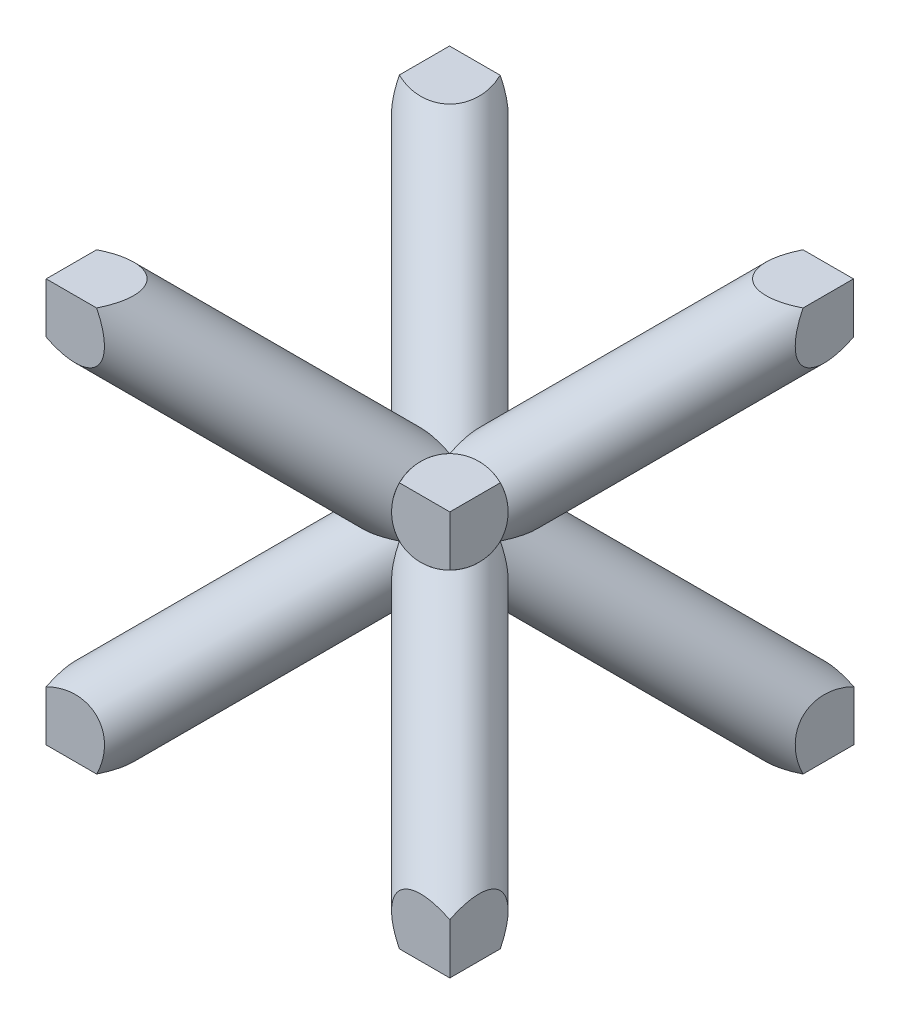
ISO-10303-21;
HEADER;
FILE_DESCRIPTION(('STEP AP214'),'2;1');
FILE_NAME('part.step','',(''),(''),'','','');
FILE_SCHEMA(('AUTOMOTIVE_DESIGN { 1 0 10303 214 1 1 1 1 }'));
ENDSEC;
DATA;
#1=APPLICATION_CONTEXT('core data for automotive mechanical design processes');
#2=APPLICATION_PROTOCOL_DEFINITION('international standard','automotive_design',2000,#1);
#3=PRODUCT_CONTEXT('',#1,'mechanical');
#4=PRODUCT('Part','Part','',(#3));
#5=PRODUCT_RELATED_PRODUCT_CATEGORY('part','',(#4));
#6=PRODUCT_DEFINITION_FORMATION('','',#4);
#7=PRODUCT_DEFINITION_CONTEXT('part definition',#1,'design');
#8=PRODUCT_DEFINITION('design','',#6,#7);
#9=PRODUCT_DEFINITION_SHAPE('','',#8);
#10=(LENGTH_UNIT() NAMED_UNIT(*) SI_UNIT(.MILLI.,.METRE.));
#11=(NAMED_UNIT(*) PLANE_ANGLE_UNIT() SI_UNIT($,.RADIAN.));
#12=(NAMED_UNIT(*) SI_UNIT($,.STERADIAN.) SOLID_ANGLE_UNIT());
#13=UNCERTAINTY_MEASURE_WITH_UNIT(LENGTH_MEASURE(1.E-05),#10,'distance_accuracy_value','');
#14=(GEOMETRIC_REPRESENTATION_CONTEXT(3) GLOBAL_UNCERTAINTY_ASSIGNED_CONTEXT((#13)) GLOBAL_UNIT_ASSIGNED_CONTEXT((#10,
#11,#12)) REPRESENTATION_CONTEXT('',''));
#15=CARTESIAN_POINT('',(0.,0.,0.));
#16=DIRECTION('',(0.,0.,1.));
#17=DIRECTION('',(1.,0.,0.));
#18=AXIS2_PLACEMENT_3D('',#15,#16,#17);
#19=CARTESIAN_POINT('',(-5.00010307764064,9.,0.));
#20=DIRECTION('',(0.,-1.,0.));
#21=DIRECTION('',(0.,0.,-1.));
#22=AXIS2_PLACEMENT_3D('',#19,#20,#21);
#23=PLANE('',#22);
#24=DIRECTION('',(0.999999672320654,0.,-0.000809542207574275));
#25=VECTOR('',#24,1.);
#26=CARTESIAN_POINT('',(-5.00333535670377,9.,-3.99272326227268));
#27=LINE('',#26,#25);
#28=CARTESIAN_POINT('',(2.99960122848684,9.,-3.99920197934588));
#29=VERTEX_POINT('',#28);
#30=CARTESIAN_POINT('',(3.99999999999999,9.,-4.0000118446412));
#31=VERTEX_POINT('',#30);
#32=EDGE_CURVE('E162',#29,#31,#27,.T.);
#33=ORIENTED_EDGE('',*,*,#32,.F.);
#34=CARTESIAN_POINT('',(3.99999999999998,9.,-3.99999999999998));
#35=DIRECTION('',(0.,1.,0.));
#36=DIRECTION('',(0.707106781186548,0.,-0.707106781186548));
#37=AXIS2_PLACEMENT_3D('',#34,#35,#36);
#38=ELLIPSE('',#37,1.41421356237307,0.816496580927711);
#39=CARTESIAN_POINT('',(4.,9.,-3.00000000000001));
#40=VERTEX_POINT('',#39);
#41=EDGE_CURVE('E177',#29,#40,#38,.T.);
#42=ORIENTED_EDGE('',*,*,#41,.T.);
#43=DIRECTION('',(0.,0.,1.));
#44=VECTOR('',#43,1.);
#45=CARTESIAN_POINT('',(3.99999999999999,8.99999999999999,-5.000025));
#46=LINE('',#45,#44);
#47=EDGE_CURVE('E118',#31,#40,#46,.T.);
#48=ORIENTED_EDGE('',*,*,#47,.F.);
#49=EDGE_LOOP('',(#33,#42,#48));
#50=FACE_BOUND('',#49,.T.);
#51=ADVANCED_FACE('F114',(#50),#23,.F.);
#52=CARTESIAN_POINT('',(-5.00010307764064,1.,0.));
#53=DIRECTION('',(0.,1.,0.));
#54=DIRECTION('',(0.,0.,1.));
#55=AXIS2_PLACEMENT_3D('',#52,#53,#54);
#56=PLANE('',#55);
#57=DIRECTION('',(-0.999999672320654,0.,0.000809542207574797));
#58=VECTOR('',#57,1.);
#59=CARTESIAN_POINT('',(-0.00324079879229594,1.,-4.00324739096831));
#60=LINE('',#59,#58);
#61=CARTESIAN_POINT('',(-2.99983716700637,1.00043199204134,-4.00049784205381));
#62=VERTEX_POINT('',#61);
#63=CARTESIAN_POINT('',(-4.,1.,-4.0000118446412));
#64=VERTEX_POINT('',#63);
#65=EDGE_CURVE('E489',#62,#64,#60,.T.);
#66=ORIENTED_EDGE('',*,*,#65,.F.);
#67=CARTESIAN_POINT('',(-4.00000000000001,0.999999999999999,-4.00000000000001));
#68=DIRECTION('',(0.,1.,0.));
#69=DIRECTION('',(-0.707106781186548,0.,-0.707106781186548));
#70=AXIS2_PLACEMENT_3D('',#67,#68,#69);
#71=ELLIPSE('',#70,1.4142135623731,0.816496580927728);
#72=CARTESIAN_POINT('',(-4.,1.,-3.));
#73=VERTEX_POINT('',#72);
#74=EDGE_CURVE('E251',#62,#73,#71,.F.);
#75=ORIENTED_EDGE('',*,*,#74,.T.);
#76=DIRECTION('',(0.,0.,1.));
#77=VECTOR('',#76,1.);
#78=CARTESIAN_POINT('',(-4.,1.,-5.000025));
#79=LINE('',#78,#77);
#80=EDGE_CURVE('E209',#64,#73,#79,.T.);
#81=ORIENTED_EDGE('',*,*,#80,.F.);
#82=EDGE_LOOP('',(#66,#75,#81));
#83=FACE_BOUND('',#82,.T.);
#84=ADVANCED_FACE('F460',(#83),#56,.F.);
#85=CARTESIAN_POINT('',(4.32692070451106,0.673079295488953,-4.32692070451106));
#86=DIRECTION('',(-0.577350269189626,0.577350269189626,0.577350269189626));
#87=DIRECTION('',(-0.707106781186548,-0.707106781186547,0.));
#88=AXIS2_PLACEMENT_3D('',#85,#86,#87);
#89=CYLINDRICAL_SURFACE('',#88,0.816496580927712);
#90=CARTESIAN_POINT('',(0.,5.00000000000002,0.));
#91=DIRECTION('',(0.,1.,0.));
#92=DIRECTION('',(-0.707106781186548,0.,0.707106781186547));
#93=AXIS2_PLACEMENT_3D('',#90,#91,#92);
#94=ELLIPSE('',#93,1.41421356237307,0.816496580927712);
#95=CARTESIAN_POINT('',(0.99999999999999,5.,0.));
#96=VERTEX_POINT('',#95);
#97=CARTESIAN_POINT('',(0.,5.,-0.999999999999998));
#98=VERTEX_POINT('',#97);
#99=EDGE_CURVE('E587',#96,#98,#94,.T.);
#100=ORIENTED_EDGE('',*,*,#99,.F.);
#101=CARTESIAN_POINT('',(0.,5.00000000000001,0.));
#102=DIRECTION('',(0.,0.,1.));
#103=DIRECTION('',(-0.707106781186547,0.707106781186548,0.));
#104=AXIS2_PLACEMENT_3D('',#101,#102,#103);
#105=ELLIPSE('',#104,1.41421356237309,0.81649658092772);
#106=CARTESIAN_POINT('',(0.,4.00000000000001,0.));
#107=VERTEX_POINT('',#106);
#108=EDGE_CURVE('E583',#96,#107,#105,.F.);
#109=ORIENTED_EDGE('',*,*,#108,.T.);
#110=CARTESIAN_POINT('',(0.,5.00000000000001,0.));
#111=DIRECTION('',(-1.,0.,0.));
#112=DIRECTION('',(0.,0.707106781186548,0.707106781186547));
#113=AXIS2_PLACEMENT_3D('',#110,#111,#112);
#114=ELLIPSE('',#113,1.41421356237308,0.81649658092772);
#115=EDGE_CURVE('E573',#107,#98,#114,.F.);
#116=ORIENTED_EDGE('',*,*,#115,.T.);
#117=EDGE_LOOP('',(#100,#109,#116));
#118=FACE_BOUND('',#117,.T.);
#119=CARTESIAN_POINT('',(4.,1.00000000000001,-4.));
#120=DIRECTION('',(1.,0.,0.));
#121=DIRECTION('',(0.,0.707106781186548,0.707106781186547));
#122=AXIS2_PLACEMENT_3D('',#119,#120,#121);
#123=ELLIPSE('',#122,1.41421356237307,0.816496580927712);
#124=CARTESIAN_POINT('',(3.99999999999999,1.99714742185702,-4.00568095123427));
#125=VERTEX_POINT('',#124);
#126=CARTESIAN_POINT('',(4.,1.,-3.00000000000002));
#127=VERTEX_POINT('',#126);
#128=EDGE_CURVE('E247',#125,#127,#123,.T.);
#129=ORIENTED_EDGE('',*,*,#128,.F.);
#130=CARTESIAN_POINT('',(4.00649870638162,0.993501293618386,-4.00649870638162));
#131=DIRECTION('',(-0.000809541942304187,0.000809541942304126,-0.999999344641629));
#132=DIRECTION('',(-0.707106317778199,0.707106317778199,0.0011448651941164));
#133=AXIS2_PLACEMENT_3D('',#130,#131,#132);
#134=ELLIPSE('',#133,1.41650793586478,0.816496580927712);
#135=CARTESIAN_POINT('',(3.00280491320505,1.00012981876958,-4.00566107221018));
#136=VERTEX_POINT('',#135);
#137=EDGE_CURVE('E493',#125,#136,#134,.F.);
#138=ORIENTED_EDGE('',*,*,#137,.T.);
#139=CARTESIAN_POINT('',(4.00000000000001,1.,-4.00000000000001));
#140=DIRECTION('',(0.,-1.,0.));
#141=DIRECTION('',(-0.707106781186548,0.,0.707106781186547));
#142=AXIS2_PLACEMENT_3D('',#139,#140,#141);
#143=ELLIPSE('',#142,1.41421356237307,0.816496580927712);
#144=EDGE_CURVE('E241',#127,#136,#143,.T.);
#145=ORIENTED_EDGE('',*,*,#144,.F.);
#146=EDGE_LOOP('',(#129,#138,#145));
#147=FACE_BOUND('',#146,.T.);
#148=ADVANCED_FACE('F120',(#118,#147),#89,.T.);
#149=CARTESIAN_POINT('',(-4.32692070451106,0.673079295488972,4.32692070451106));
#150=DIRECTION('',(0.577350269189626,0.577350269189625,-0.577350269189626));
#151=DIRECTION('',(-0.707106781186547,0.,-0.707106781186547));
#152=AXIS2_PLACEMENT_3D('',#149,#150,#151);
#153=CYLINDRICAL_SURFACE('',#152,0.816496580927711);
#154=CARTESIAN_POINT('',(0.,5.00000000000002,0.));
#155=DIRECTION('',(0.,0.,-1.));
#156=DIRECTION('',(-0.707106781186548,-0.707106781186547,0.));
#157=AXIS2_PLACEMENT_3D('',#154,#155,#156);
#158=ELLIPSE('',#157,1.41421356237308,0.816496580927719);
#159=CARTESIAN_POINT('',(0.,6.,0.));
#160=VERTEX_POINT('',#159);
#161=EDGE_CURVE('E206',#96,#160,#158,.F.);
#162=ORIENTED_EDGE('',*,*,#161,.F.);
#163=ORIENTED_EDGE('',*,*,#99,.T.);
#164=CARTESIAN_POINT('',(0.,5.00000000000001,0.));
#165=DIRECTION('',(1.,0.,0.));
#166=DIRECTION('',(0.,-0.707106781186547,0.707106781186548));
#167=AXIS2_PLACEMENT_3D('',#164,#165,#166);
#168=ELLIPSE('',#167,1.41421356237308,0.816496580927719);
#169=EDGE_CURVE('E219',#160,#98,#168,.F.);
#170=ORIENTED_EDGE('',*,*,#169,.F.);
#171=EDGE_LOOP('',(#162,#163,#170));
#172=FACE_BOUND('',#171,.T.);
#173=ORIENTED_EDGE('',*,*,#41,.F.);
#174=CARTESIAN_POINT('',(4.0000118446412,9.00001184464122,-4.0000118446412));
#175=DIRECTION('',(-0.000809541942304187,0.000809541942304126,-0.999999344641629));
#176=DIRECTION('',(0.7076789815169,0.706534117448227,-9.26816089267396E-07));
#177=AXIS2_PLACEMENT_3D('',#174,#175,#176);
#178=ELLIPSE('',#177,1.41421448919037,0.816496580927711);
#179=CARTESIAN_POINT('',(3.99999999999999,8.0004107800841,-4.00082105457012));
#180=VERTEX_POINT('',#179);
#181=EDGE_CURVE('E165',#29,#180,#178,.F.);
#182=ORIENTED_EDGE('',*,*,#181,.T.);
#183=CARTESIAN_POINT('',(4.,9.00000000000002,-4.));
#184=DIRECTION('',(1.,0.,0.));
#185=DIRECTION('',(0.,0.707106781186547,-0.707106781186548));
#186=AXIS2_PLACEMENT_3D('',#183,#184,#185);
#187=ELLIPSE('',#186,1.41421356237307,0.816496580927711);
#188=EDGE_CURVE('E176',#40,#180,#187,.T.);
#189=ORIENTED_EDGE('',*,*,#188,.F.);
#190=EDGE_LOOP('',(#173,#182,#189));
#191=FACE_BOUND('',#190,.T.);
#192=ADVANCED_FACE('F461',(#172,#191),#153,.T.);
#193=DIRECTION('',(-0.999999672320654,0.,0.000809542207574275));
#194=VECTOR('',#193,1.);
#195=CARTESIAN_POINT('',(-5.00334059957245,1.,-3.99919959781111));
#196=LINE('',#195,#194);
#197=CARTESIAN_POINT('',(4.,1.,-4.00648818442395));
#198=VERTEX_POINT('',#197);
#199=EDGE_CURVE('E180',#198,#136,#196,.T.);
#200=ORIENTED_EDGE('',*,*,#199,.F.);
#201=DIRECTION('',(0.,0.,1.));
#202=VECTOR('',#201,1.);
#203=CARTESIAN_POINT('',(4.,1.,0.));
#204=LINE('',#203,#202);
#205=EDGE_CURVE('E218',#198,#127,#204,.T.);
#206=ORIENTED_EDGE('',*,*,#205,.T.);
#207=ORIENTED_EDGE('',*,*,#144,.T.);
#208=EDGE_LOOP('',(#200,#206,#207));
#209=FACE_BOUND('',#208,.T.);
#210=ADVANCED_FACE('F455',(#209),#56,.F.);
#211=CARTESIAN_POINT('',(3.99999999999999,1.,-5.000025));
#212=DIRECTION('',(-1.,0.,0.));
#213=DIRECTION('',(0.,0.,1.));
#214=AXIS2_PLACEMENT_3D('',#211,#212,#213);
#215=PLANE('',#214);
#216=DIRECTION('',(0.,-0.999999672320654,-0.000809542207574214));
#217=VECTOR('',#216,1.);
#218=CARTESIAN_POINT('',(3.99999999999999,0.999195690276568,-4.00648883554684));
#219=LINE('',#218,#217);
#220=EDGE_CURVE('E135',#31,#180,#219,.T.);
#221=ORIENTED_EDGE('',*,*,#220,.F.);
#222=ORIENTED_EDGE('',*,*,#47,.T.);
#223=ORIENTED_EDGE('',*,*,#188,.T.);
#224=EDGE_LOOP('',(#221,#222,#223));
#225=FACE_BOUND('',#224,.T.);
#226=ADVANCED_FACE('F172',(#225),#215,.F.);
#227=CARTESIAN_POINT('',(-4.,9.,-5.000025));
#228=DIRECTION('',(1.,0.,0.));
#229=DIRECTION('',(0.,1.,0.));
#230=AXIS2_PLACEMENT_3D('',#227,#228,#229);
#231=PLANE('',#230);
#232=DIRECTION('',(0.,0.999999672320654,0.000809542207574186));
#233=VECTOR('',#232,1.);
#234=CARTESIAN_POINT('',(-4.,0.00323883271653579,-4.0008187651414));
#235=LINE('',#234,#233);
#236=CARTESIAN_POINT('',(-4.,2.00039877151318,-3.99920197934588));
#237=VERTEX_POINT('',#236);
#238=EDGE_CURVE('E169',#64,#237,#235,.T.);
#239=ORIENTED_EDGE('',*,*,#238,.F.);
#240=ORIENTED_EDGE('',*,*,#80,.T.);
#241=CARTESIAN_POINT('',(-4.,1.00000000000001,-4.));
#242=DIRECTION('',(-1.,0.,0.));
#243=DIRECTION('',(0.,-0.707106781186547,-0.707106781186548));
#244=AXIS2_PLACEMENT_3D('',#241,#242,#243);
#245=ELLIPSE('',#244,1.4142135623731,0.816496580927728);
#246=EDGE_CURVE('E257',#237,#73,#245,.F.);
#247=ORIENTED_EDGE('',*,*,#246,.F.);
#248=EDGE_LOOP('',(#239,#240,#247));
#249=FACE_BOUND('',#248,.T.);
#250=ADVANCED_FACE('F448',(#249),#231,.F.);
#251=DIRECTION('',(0.,-0.999999672320654,-0.000809542207574214));
#252=VECTOR('',#251,1.);
#253=CARTESIAN_POINT('',(3.99999999999999,0.999195690276568,-4.00648883554684));
#254=LINE('',#253,#252);
#255=EDGE_CURVE('E123',#125,#198,#254,.T.);
#256=ORIENTED_EDGE('',*,*,#255,.F.);
#257=ORIENTED_EDGE('',*,*,#128,.T.);
#258=ORIENTED_EDGE('',*,*,#205,.F.);
#259=EDGE_LOOP('',(#256,#257,#258));
#260=FACE_BOUND('',#259,.T.);
#261=ADVANCED_FACE('F451',(#260),#215,.F.);
#262=DIRECTION('',(1.,0.,0.));
#263=VECTOR('',#262,1.);
#264=CARTESIAN_POINT('',(-2.8452994616208,1.,4.));
#265=LINE('',#264,#263);
#266=CARTESIAN_POINT('',(-4.,1.,4.));
#267=VERTEX_POINT('',#266);
#268=CARTESIAN_POINT('',(-3.00000000000003,1.,4.));
#269=VERTEX_POINT('',#268);
#270=EDGE_CURVE('E403',#267,#269,#265,.T.);
#271=ORIENTED_EDGE('',*,*,#270,.F.);
#272=DIRECTION('',(0.,0.,1.));
#273=VECTOR('',#272,1.);
#274=CARTESIAN_POINT('',(-4.,1.,-5.000025));
#275=LINE('',#274,#273);
#276=CARTESIAN_POINT('',(-4.,1.,3.00000000000003));
#277=VERTEX_POINT('',#276);
#278=EDGE_CURVE('E182',#277,#267,#275,.T.);
#279=ORIENTED_EDGE('',*,*,#278,.F.);
#280=CARTESIAN_POINT('',(-4.00000000000003,1.,4.00000000000003));
#281=DIRECTION('',(0.,1.,0.));
#282=DIRECTION('',(0.707106781186548,0.,-0.707106781186548));
#283=AXIS2_PLACEMENT_3D('',#280,#281,#282);
#284=ELLIPSE('',#283,1.41421356237307,0.816496580927711);
#285=EDGE_CURVE('E401',#269,#277,#284,.T.);
#286=ORIENTED_EDGE('',*,*,#285,.F.);
#287=EDGE_LOOP('',(#271,#279,#286));
#288=FACE_BOUND('',#287,.T.);
#289=ADVANCED_FACE('F405',(#288),#56,.F.);
#290=DIRECTION('',(-1.,0.,0.));
#291=VECTOR('',#290,1.);
#292=CARTESIAN_POINT('',(4.,9.,4.));
#293=LINE('',#292,#291);
#294=CARTESIAN_POINT('',(4.,9.,4.));
#295=VERTEX_POINT('',#294);
#296=CARTESIAN_POINT('',(3.,9.,4.));
#297=VERTEX_POINT('',#296);
#298=EDGE_CURVE('E377',#295,#297,#293,.T.);
#299=ORIENTED_EDGE('',*,*,#298,.F.);
#300=DIRECTION('',(0.,0.,1.));
#301=VECTOR('',#300,1.);
#302=CARTESIAN_POINT('',(3.99999999999999,8.99999999999999,-5.000025));
#303=LINE('',#302,#301);
#304=CARTESIAN_POINT('',(3.99999999999999,8.99999999999999,2.99999999999999));
#305=VERTEX_POINT('',#304);
#306=EDGE_CURVE('E181',#305,#295,#303,.T.);
#307=ORIENTED_EDGE('',*,*,#306,.F.);
#308=CARTESIAN_POINT('',(4.,9.,4.));
#309=DIRECTION('',(0.,-1.,0.));
#310=DIRECTION('',(-0.707106781186548,0.,-0.707106781186548));
#311=AXIS2_PLACEMENT_3D('',#308,#309,#310);
#312=ELLIPSE('',#311,1.4142135623731,0.816496580927728);
#313=EDGE_CURVE('E244',#305,#297,#312,.F.);
#314=ORIENTED_EDGE('',*,*,#313,.T.);
#315=EDGE_LOOP('',(#299,#307,#314));
#316=FACE_BOUND('',#315,.T.);
#317=ADVANCED_FACE('F456',(#316),#23,.F.);
#318=CARTESIAN_POINT('',(4.32692070451105,9.32692070451106,4.32692070451105));
#319=DIRECTION('',(-0.577350269189626,-0.577350269189626,-0.577350269189626));
#320=DIRECTION('',(-0.707106781186548,0.,0.707106781186548));
#321=AXIS2_PLACEMENT_3D('',#318,#319,#320);
#322=CYLINDRICAL_SURFACE('',#321,0.816496580927728);
#323=CARTESIAN_POINT('',(0.,5.,0.));
#324=DIRECTION('',(0.,-1.,0.));
#325=DIRECTION('',(-0.707106781186548,0.,-0.707106781186548));
#326=AXIS2_PLACEMENT_3D('',#323,#324,#325);
#327=ELLIPSE('',#326,1.4142135623731,0.816496580927728);
#328=CARTESIAN_POINT('',(0.,5.,0.999999999999997));
#329=VERTEX_POINT('',#328);
#330=EDGE_CURVE('E575',#96,#329,#327,.T.);
#331=ORIENTED_EDGE('',*,*,#330,.F.);
#332=ORIENTED_EDGE('',*,*,#161,.T.);
#333=CARTESIAN_POINT('',(0.,5.00000000000001,0.));
#334=DIRECTION('',(-1.,0.,0.));
#335=DIRECTION('',(0.,0.707106781186548,0.707106781186547));
#336=AXIS2_PLACEMENT_3D('',#333,#334,#335);
#337=ELLIPSE('',#336,1.41421356237308,0.81649658092772);
#338=EDGE_CURVE('E252',#329,#160,#337,.T.);
#339=ORIENTED_EDGE('',*,*,#338,.F.);
#340=EDGE_LOOP('',(#331,#332,#339));
#341=FACE_BOUND('',#340,.T.);
#342=CARTESIAN_POINT('',(4.,9.,4.));
#343=DIRECTION('',(0.,0.,1.));
#344=DIRECTION('',(-0.707106781186548,-0.707106781186547,0.));
#345=AXIS2_PLACEMENT_3D('',#342,#343,#344);
#346=ELLIPSE('',#345,1.4142135623731,0.816496580927728);
#347=CARTESIAN_POINT('',(4.,8.,4.));
#348=VERTEX_POINT('',#347);
#349=EDGE_CURVE('E187',#297,#348,#346,.T.);
#350=ORIENTED_EDGE('',*,*,#349,.F.);
#351=ORIENTED_EDGE('',*,*,#313,.F.);
#352=CARTESIAN_POINT('',(4.,9.,4.));
#353=DIRECTION('',(1.,0.,0.));
#354=DIRECTION('',(0.,-0.707106781186547,-0.707106781186548));
#355=AXIS2_PLACEMENT_3D('',#352,#353,#354);
#356=ELLIPSE('',#355,1.4142135623731,0.816496580927728);
#357=EDGE_CURVE('E259',#305,#348,#356,.F.);
#358=ORIENTED_EDGE('',*,*,#357,.T.);
#359=EDGE_LOOP('',(#350,#351,#358));
#360=FACE_BOUND('',#359,.T.);
#361=ADVANCED_FACE('F468',(#341,#360),#322,.T.);
#362=CARTESIAN_POINT('',(-4.32692070451105,9.32692070451106,-4.32692070451105));
#363=DIRECTION('',(0.577350269189626,-0.577350269189626,0.577350269189626));
#364=DIRECTION('',(0.707106781186548,0.,-0.707106781186548));
#365=AXIS2_PLACEMENT_3D('',#362,#363,#364);
#366=CYLINDRICAL_SURFACE('',#365,0.816496580927728);
#367=ORIENTED_EDGE('',*,*,#330,.T.);
#368=CARTESIAN_POINT('',(0.,5.00000000000001,0.));
#369=DIRECTION('',(1.,0.,0.));
#370=DIRECTION('',(0.,-0.707106781186547,0.707106781186548));
#371=AXIS2_PLACEMENT_3D('',#368,#369,#370);
#372=ELLIPSE('',#371,1.41421356237308,0.816496580927719);
#373=EDGE_CURVE('E579',#329,#107,#372,.T.);
#374=ORIENTED_EDGE('',*,*,#373,.T.);
#375=ORIENTED_EDGE('',*,*,#108,.F.);
#376=EDGE_LOOP('',(#367,#374,#375));
#377=FACE_BOUND('',#376,.T.);
#378=CARTESIAN_POINT('',(4.,1.00000000000001,4.));
#379=DIRECTION('',(0.,0.,1.));
#380=DIRECTION('',(0.707106781186548,-0.707106781186547,0.));
#381=AXIS2_PLACEMENT_3D('',#378,#379,#380);
#382=ELLIPSE('',#381,1.4142135623731,0.816496580927728);
#383=CARTESIAN_POINT('',(4.,2.00000000000001,4.));
#384=VERTEX_POINT('',#383);
#385=CARTESIAN_POINT('',(3.,1.,4.));
#386=VERTEX_POINT('',#385);
#387=EDGE_CURVE('E195',#384,#386,#382,.T.);
#388=ORIENTED_EDGE('',*,*,#387,.F.);
#389=CARTESIAN_POINT('',(4.,1.00000000000001,4.));
#390=DIRECTION('',(1.,0.,0.));
#391=DIRECTION('',(0.,-0.707106781186547,0.707106781186548));
#392=AXIS2_PLACEMENT_3D('',#389,#390,#391);
#393=ELLIPSE('',#392,1.4142135623731,0.816496580927728);
#394=CARTESIAN_POINT('',(4.,1.,3.));
#395=VERTEX_POINT('',#394);
#396=EDGE_CURVE('E220',#384,#395,#393,.F.);
#397=ORIENTED_EDGE('',*,*,#396,.T.);
#398=CARTESIAN_POINT('',(4.00000000000001,0.999999999999999,4.00000000000001));
#399=DIRECTION('',(0.,1.,0.));
#400=DIRECTION('',(0.707106781186548,0.,0.707106781186548));
#401=AXIS2_PLACEMENT_3D('',#398,#399,#400);
#402=ELLIPSE('',#401,1.4142135623731,0.816496580927728);
#403=EDGE_CURVE('E224',#386,#395,#402,.F.);
#404=ORIENTED_EDGE('',*,*,#403,.F.);
#405=EDGE_LOOP('',(#388,#397,#404));
#406=FACE_BOUND('',#405,.T.);
#407=ADVANCED_FACE('F374',(#377,#406),#366,.T.);
#408=DIRECTION('',(1.,0.,0.));
#409=VECTOR('',#408,1.);
#410=CARTESIAN_POINT('',(2.8452994616208,1.,4.));
#411=LINE('',#410,#409);
#412=CARTESIAN_POINT('',(4.,1.,4.));
#413=VERTEX_POINT('',#412);
#414=EDGE_CURVE('E361',#386,#413,#411,.T.);
#415=ORIENTED_EDGE('',*,*,#414,.F.);
#416=ORIENTED_EDGE('',*,*,#403,.T.);
#417=DIRECTION('',(0.,0.,1.));
#418=VECTOR('',#417,1.);
#419=CARTESIAN_POINT('',(3.99999999999999,1.,-5.000025));
#420=LINE('',#419,#418);
#421=EDGE_CURVE('E179',#395,#413,#420,.T.);
#422=ORIENTED_EDGE('',*,*,#421,.T.);
#423=EDGE_LOOP('',(#415,#416,#422));
#424=FACE_BOUND('',#423,.T.);
#425=ADVANCED_FACE('F371',(#424),#56,.F.);
#426=DIRECTION('',(-1.,0.,0.));
#427=VECTOR('',#426,1.);
#428=CARTESIAN_POINT('',(-4.,9.,4.));
#429=LINE('',#428,#427);
#430=CARTESIAN_POINT('',(-3.00000000000001,9.,4.));
#431=VERTEX_POINT('',#430);
#432=CARTESIAN_POINT('',(-4.,9.,4.));
#433=VERTEX_POINT('',#432);
#434=EDGE_CURVE('E409',#431,#433,#429,.T.);
#435=ORIENTED_EDGE('',*,*,#434,.F.);
#436=CARTESIAN_POINT('',(-3.99999999999998,9.,3.99999999999998));
#437=DIRECTION('',(0.,1.,0.));
#438=DIRECTION('',(-0.707106781186548,0.,0.707106781186547));
#439=AXIS2_PLACEMENT_3D('',#436,#437,#438);
#440=ELLIPSE('',#439,1.41421356237307,0.816496580927712);
#441=CARTESIAN_POINT('',(-4.,9.,3.00000000000001));
#442=VERTEX_POINT('',#441);
#443=EDGE_CURVE('E225',#431,#442,#440,.T.);
#444=ORIENTED_EDGE('',*,*,#443,.T.);
#445=DIRECTION('',(0.,0.,1.));
#446=VECTOR('',#445,1.);
#447=CARTESIAN_POINT('',(-4.,9.,-5.000025));
#448=LINE('',#447,#446);
#449=EDGE_CURVE('E214',#442,#433,#448,.T.);
#450=ORIENTED_EDGE('',*,*,#449,.T.);
#451=EDGE_LOOP('',(#435,#444,#450));
#452=FACE_BOUND('',#451,.T.);
#453=ADVANCED_FACE('F531',(#452),#23,.F.);
#454=DIRECTION('',(0.,-1.,0.));
#455=VECTOR('',#454,1.);
#456=CARTESIAN_POINT('',(-4.,1.,4.));
#457=LINE('',#456,#455);
#458=CARTESIAN_POINT('',(-4.,2.00000000000001,4.));
#459=VERTEX_POINT('',#458);
#460=EDGE_CURVE('E373',#459,#267,#457,.T.);
#461=ORIENTED_EDGE('',*,*,#460,.F.);
#462=CARTESIAN_POINT('',(-4.,1.00000000000003,4.));
#463=DIRECTION('',(-1.,0.,0.));
#464=DIRECTION('',(0.,0.707106781186547,-0.707106781186548));
#465=AXIS2_PLACEMENT_3D('',#462,#463,#464);
#466=ELLIPSE('',#465,1.41421356237307,0.816496580927711);
#467=EDGE_CURVE('E396',#459,#277,#466,.T.);
#468=ORIENTED_EDGE('',*,*,#467,.T.);
#469=ORIENTED_EDGE('',*,*,#278,.T.);
#470=EDGE_LOOP('',(#461,#468,#469));
#471=FACE_BOUND('',#470,.T.);
#472=ADVANCED_FACE('F391',(#471),#231,.F.);
#473=DIRECTION('',(0.,1.,0.));
#474=VECTOR('',#473,1.);
#475=CARTESIAN_POINT('',(4.,1.,4.));
#476=LINE('',#475,#474);
#477=EDGE_CURVE('E362',#413,#384,#476,.T.);
#478=ORIENTED_EDGE('',*,*,#477,.F.);
#479=ORIENTED_EDGE('',*,*,#421,.F.);
#480=ORIENTED_EDGE('',*,*,#396,.F.);
#481=EDGE_LOOP('',(#478,#479,#480));
#482=FACE_BOUND('',#481,.T.);
#483=ADVANCED_FACE('F380',(#482),#215,.F.);
#484=EDGE_CURVE('E255',#348,#295,#476,.T.);
#485=ORIENTED_EDGE('',*,*,#484,.F.);
#486=ORIENTED_EDGE('',*,*,#357,.F.);
#487=ORIENTED_EDGE('',*,*,#306,.T.);
#488=EDGE_LOOP('',(#485,#486,#487));
#489=FACE_BOUND('',#488,.T.);
#490=ADVANCED_FACE('F458',(#489),#215,.F.);
#491=CARTESIAN_POINT('',(-4.,8.00000000000003,4.));
#492=VERTEX_POINT('',#491);
#493=EDGE_CURVE('E407',#433,#492,#457,.T.);
#494=ORIENTED_EDGE('',*,*,#493,.F.);
#495=ORIENTED_EDGE('',*,*,#449,.F.);
#496=CARTESIAN_POINT('',(-4.,9.00000000000002,4.));
#497=DIRECTION('',(-1.,0.,0.));
#498=DIRECTION('',(0.,0.707106781186548,0.707106781186547));
#499=AXIS2_PLACEMENT_3D('',#496,#497,#498);
#500=ELLIPSE('',#499,1.41421356237307,0.816496580927712);
#501=EDGE_CURVE('E242',#442,#492,#500,.T.);
#502=ORIENTED_EDGE('',*,*,#501,.T.);
#503=EDGE_LOOP('',(#494,#495,#502));
#504=FACE_BOUND('',#503,.T.);
#505=ADVANCED_FACE('F453',(#504),#231,.F.);
#506=CARTESIAN_POINT('',(-4.,9.00000000000002,4.));
#507=DIRECTION('',(0.,0.,-1.));
#508=DIRECTION('',(-0.707106781186547,0.707106781186548,0.));
#509=AXIS2_PLACEMENT_3D('',#506,#507,#508);
#510=ELLIPSE('',#509,1.41421356237307,0.816496580927712);
#511=EDGE_CURVE('E367',#492,#431,#510,.F.);
#512=ORIENTED_EDGE('',*,*,#511,.F.);
#513=ORIENTED_EDGE('',*,*,#501,.F.);
#514=ORIENTED_EDGE('',*,*,#443,.F.);
#515=EDGE_LOOP('',(#512,#513,#514));
#516=FACE_BOUND('',#515,.T.);
#517=CARTESIAN_POINT('',(0.,5.00000000000002,0.));
#518=DIRECTION('',(0.,1.,0.));
#519=DIRECTION('',(-0.707106781186548,0.,0.707106781186547));
#520=AXIS2_PLACEMENT_3D('',#517,#518,#519);
#521=ELLIPSE('',#520,1.41421356237307,0.816496580927712);
#522=CARTESIAN_POINT('',(-0.999999999999997,5.,0.));
#523=VERTEX_POINT('',#522);
#524=EDGE_CURVE('E557',#329,#523,#521,.F.);
#525=ORIENTED_EDGE('',*,*,#524,.F.);
#526=ORIENTED_EDGE('',*,*,#338,.T.);
#527=CARTESIAN_POINT('',(0.,5.00000000000001,0.));
#528=DIRECTION('',(0.,0.,1.));
#529=DIRECTION('',(-0.707106781186547,0.707106781186548,0.));
#530=AXIS2_PLACEMENT_3D('',#527,#528,#529);
#531=ELLIPSE('',#530,1.41421356237309,0.81649658092772);
#532=EDGE_CURVE('E223',#160,#523,#531,.T.);
#533=ORIENTED_EDGE('',*,*,#532,.T.);
#534=EDGE_LOOP('',(#525,#526,#533));
#535=FACE_BOUND('',#534,.T.);
#536=ADVANCED_FACE('F536',(#516,#535),#89,.T.);
#537=ORIENTED_EDGE('',*,*,#74,.F.);
#538=CARTESIAN_POINT('',(-4.0000118446412,0.999988155358808,-4.0000118446412));
#539=DIRECTION('',(0.000809541942304709,-0.000809541942304098,0.999999344641629));
#540=DIRECTION('',(-0.706534117448227,-0.707678981516899,-9.26816088791431E-07));
#541=AXIS2_PLACEMENT_3D('',#538,#539,#540);
#542=ELLIPSE('',#541,1.4142144891904,0.816496580927728);
#543=CARTESIAN_POINT('',(-2.85083022938074,1.48154909551441,-4.00055231193345));
#544=VERTEX_POINT('',#543);
#545=EDGE_CURVE('E508',#62,#544,#542,.T.);
#546=ORIENTED_EDGE('',*,*,#545,.T.);
#547=CARTESIAN_POINT('',(-2.85076971803935,1.66801051021194,-4.0004014124852));
#548=DIRECTION('',(-0.000324524612673398,-0.999999619875203,-0.000809279448664072));
#549=VECTOR('',#548,1.);
#550=LINE('',#547,#549);
#551=CARTESIAN_POINT('',(-2.85076971803935,1.66801051021194,-4.0004014124852));
#552=VERTEX_POINT('',#551);
#553=EDGE_CURVE('E379',#552,#544,#550,.T.);
#554=ORIENTED_EDGE('',*,*,#553,.F.);
#555=EDGE_CURVE('E510',#552,#237,#542,.T.);
#556=ORIENTED_EDGE('',*,*,#555,.T.);
#557=ORIENTED_EDGE('',*,*,#246,.T.);
#558=EDGE_LOOP('',(#537,#546,#554,#556,#557));
#559=FACE_BOUND('',#558,.T.);
#560=ORIENTED_EDGE('',*,*,#115,.F.);
#561=CARTESIAN_POINT('',(0.,5.00000000000002,0.));
#562=DIRECTION('',(0.,0.,-1.));
#563=DIRECTION('',(-0.707106781186548,-0.707106781186547,0.));
#564=AXIS2_PLACEMENT_3D('',#561,#562,#563);
#565=ELLIPSE('',#564,1.41421356237308,0.816496580927719);
#566=EDGE_CURVE('E566',#107,#523,#565,.T.);
#567=ORIENTED_EDGE('',*,*,#566,.T.);
#568=CARTESIAN_POINT('',(0.,5.,0.));
#569=DIRECTION('',(0.,-1.,0.));
#570=DIRECTION('',(-0.707106781186548,0.,-0.707106781186548));
#571=AXIS2_PLACEMENT_3D('',#568,#569,#570);
#572=ELLIPSE('',#571,1.4142135623731,0.816496580927728);
#573=EDGE_CURVE('E591',#98,#523,#572,.F.);
#574=ORIENTED_EDGE('',*,*,#573,.F.);
#575=EDGE_LOOP('',(#560,#567,#574));
#576=FACE_BOUND('',#575,.T.);
#577=ADVANCED_FACE('F469',(#559,#576),#322,.T.);
#578=CARTESIAN_POINT('',(-2.8478349084337,7.8478349084337,-2.8478349084337));
#579=DIRECTION('',(0.999999619662737,-0.000323869254337822,-0.000809804350862433));
#580=DIRECTION('',(0.0003440621184427,-0.706706104030464,0.707507147771202));
#581=AXIS2_PLACEMENT_3D('',#578,#579,#580);
#582=ELLIPSE('',#581,1.41490165088321,0.816496580927728);
#583=CARTESIAN_POINT('',(-2.84861674345508,8.30224927604832,-3.99503245735363));
#584=VERTEX_POINT('',#583);
#585=CARTESIAN_POINT('',(-2.84853890692405,8.54209703613863,-3.9948383534168));
#586=VERTEX_POINT('',#585);
#587=EDGE_CURVE('E13',#584,#586,#582,.T.);
#588=ORIENTED_EDGE('',*,*,#587,.T.);
#589=CARTESIAN_POINT('',(-3.99354595450634,8.99354595450634,-3.99354595450634));
#590=DIRECTION('',(0.000809541942304709,-0.000809541942304098,0.999999344641629));
#591=DIRECTION('',(0.707106317778199,-0.707106317778199,-0.00114486519411675));
#592=AXIS2_PLACEMENT_3D('',#589,#590,#591);
#593=ELLIPSE('',#592,1.41192845708115,0.816496580927728);
#594=CARTESIAN_POINT('',(-2.99718564517996,9.00000000000001,-3.99434732567105));
#595=VERTEX_POINT('',#594);
#596=EDGE_CURVE('E506',#586,#595,#593,.T.);
#597=ORIENTED_EDGE('',*,*,#596,.T.);
#598=CARTESIAN_POINT('',(-4.,9.,-4.));
#599=DIRECTION('',(0.,-1.,0.));
#600=DIRECTION('',(0.707106781186548,0.,0.707106781186548));
#601=AXIS2_PLACEMENT_3D('',#598,#599,#600);
#602=ELLIPSE('',#601,1.4142135623731,0.816496580927728);
#603=CARTESIAN_POINT('',(-4.,9.,-3.));
#604=VERTEX_POINT('',#603);
#605=EDGE_CURVE('E238',#604,#595,#602,.F.);
#606=ORIENTED_EDGE('',*,*,#605,.F.);
#607=CARTESIAN_POINT('',(-4.,9.,-4.));
#608=DIRECTION('',(-1.,0.,0.));
#609=DIRECTION('',(0.,-0.707106781186547,0.707106781186548));
#610=AXIS2_PLACEMENT_3D('',#607,#608,#609);
#611=ELLIPSE('',#610,1.4142135623731,0.816496580927728);
#612=CARTESIAN_POINT('',(-4.,7.99718564517996,-3.99434732567105));
#613=VERTEX_POINT('',#612);
#614=EDGE_CURVE('E234',#604,#613,#611,.F.);
#615=ORIENTED_EDGE('',*,*,#614,.T.);
#616=EDGE_CURVE('E277',#613,#584,#593,.T.);
#617=ORIENTED_EDGE('',*,*,#616,.T.);
#618=EDGE_LOOP('',(#588,#597,#606,#615,#617));
#619=FACE_BOUND('',#618,.T.);
#620=ORIENTED_EDGE('',*,*,#532,.F.);
#621=ORIENTED_EDGE('',*,*,#169,.T.);
#622=ORIENTED_EDGE('',*,*,#573,.T.);
#623=EDGE_LOOP('',(#620,#621,#622));
#624=FACE_BOUND('',#623,.T.);
#625=ADVANCED_FACE('F273',(#619,#624),#366,.T.);
#626=CARTESIAN_POINT('',(-4.,1.00000000000003,4.));
#627=DIRECTION('',(0.,0.,-1.));
#628=DIRECTION('',(0.707106781186548,0.707106781186547,0.));
#629=AXIS2_PLACEMENT_3D('',#626,#627,#628);
#630=ELLIPSE('',#629,1.41421356237307,0.816496580927711);
#631=EDGE_CURVE('E413',#269,#459,#630,.F.);
#632=ORIENTED_EDGE('',*,*,#631,.F.);
#633=ORIENTED_EDGE('',*,*,#285,.T.);
#634=ORIENTED_EDGE('',*,*,#467,.F.);
#635=EDGE_LOOP('',(#632,#633,#634));
#636=FACE_BOUND('',#635,.T.);
#637=ORIENTED_EDGE('',*,*,#373,.F.);
#638=ORIENTED_EDGE('',*,*,#524,.T.);
#639=ORIENTED_EDGE('',*,*,#566,.F.);
#640=EDGE_LOOP('',(#637,#638,#639));
#641=FACE_BOUND('',#640,.T.);
#642=ADVANCED_FACE('F470',(#636,#641),#153,.T.);
#643=ORIENTED_EDGE('',*,*,#605,.T.);
#644=DIRECTION('',(0.999999672320654,0.,-0.000809542207574797));
#645=VECTOR('',#644,1.);
#646=CARTESIAN_POINT('',(-0.00323555592360919,9.00000000000001,-3.99677105542988));
#647=LINE('',#646,#645);
#648=CARTESIAN_POINT('',(-4.,9.00000000000001,-3.99353550485844));
#649=VERTEX_POINT('',#648);
#650=EDGE_CURVE('E328',#649,#595,#647,.T.);
#651=ORIENTED_EDGE('',*,*,#650,.F.);
#652=EDGE_CURVE('E202',#649,#604,#448,.T.);
#653=ORIENTED_EDGE('',*,*,#652,.T.);
#654=EDGE_LOOP('',(#643,#651,#653));
#655=FACE_BOUND('',#654,.T.);
#656=ADVANCED_FACE('F446',(#655),#23,.F.);
#657=ORIENTED_EDGE('',*,*,#652,.F.);
#658=DIRECTION('',(0.,-0.999999672320654,-0.000809542207574186));
#659=VECTOR('',#658,1.);
#660=CARTESIAN_POINT('',(-4.,8.9991852045392,-3.99353616446997));
#661=LINE('',#660,#659);
#662=EDGE_CURVE('E287',#649,#613,#661,.T.);
#663=ORIENTED_EDGE('',*,*,#662,.T.);
#664=ORIENTED_EDGE('',*,*,#614,.F.);
#665=EDGE_LOOP('',(#657,#663,#664));
#666=FACE_BOUND('',#665,.T.);
#667=ADVANCED_FACE('F285',(#666),#231,.F.);
#668=CARTESIAN_POINT('',(0.,0.,4.));
#669=DIRECTION('',(0.,0.,-1.));
#670=DIRECTION('',(-1.,0.,0.));
#671=AXIS2_PLACEMENT_3D('',#668,#669,#670);
#672=PLANE('',#671);
#673=ORIENTED_EDGE('',*,*,#270,.T.);
#674=ORIENTED_EDGE('',*,*,#631,.T.);
#675=ORIENTED_EDGE('',*,*,#460,.T.);
#676=EDGE_LOOP('',(#673,#674,#675));
#677=FACE_BOUND('',#676,.T.);
#678=ADVANCED_FACE('F441',(#677),#672,.F.);
#679=CARTESIAN_POINT('',(0.,0.,4.));
#680=DIRECTION('',(0.,0.,1.));
#681=DIRECTION('',(1.,0.,0.));
#682=AXIS2_PLACEMENT_3D('',#679,#680,#681);
#683=PLANE('',#682);
#684=ORIENTED_EDGE('',*,*,#387,.T.);
#685=ORIENTED_EDGE('',*,*,#414,.T.);
#686=ORIENTED_EDGE('',*,*,#477,.T.);
#687=EDGE_LOOP('',(#684,#685,#686));
#688=FACE_BOUND('',#687,.T.);
#689=ADVANCED_FACE('F365',(#688),#683,.T.);
#690=ORIENTED_EDGE('',*,*,#349,.T.);
#691=ORIENTED_EDGE('',*,*,#484,.T.);
#692=ORIENTED_EDGE('',*,*,#298,.T.);
#693=EDGE_LOOP('',(#690,#691,#692));
#694=FACE_BOUND('',#693,.T.);
#695=ADVANCED_FACE('F443',(#694),#683,.T.);
#696=ORIENTED_EDGE('',*,*,#511,.T.);
#697=ORIENTED_EDGE('',*,*,#434,.T.);
#698=ORIENTED_EDGE('',*,*,#493,.T.);
#699=EDGE_LOOP('',(#696,#697,#698));
#700=FACE_BOUND('',#699,.T.);
#701=ADVANCED_FACE('F437',(#700),#672,.F.);
#702=CARTESIAN_POINT('',(-0.00324145202656576,0.00324145202656545,-4.00405430881924));
#703=DIRECTION('',(-0.000809541942304187,0.000809541942304126,-0.999999344641629));
#704=DIRECTION('',(-0.999999672320654,0.,0.000809542207574275));
#705=AXIS2_PLACEMENT_3D('',#702,#703,#704);
#706=PLANE('',#705);
#707=ORIENTED_EDGE('',*,*,#255,.T.);
#708=ORIENTED_EDGE('',*,*,#199,.T.);
#709=ORIENTED_EDGE('',*,*,#137,.F.);
#710=EDGE_LOOP('',(#707,#708,#709));
#711=FACE_BOUND('',#710,.T.);
#712=ADVANCED_FACE('F436',(#711),#706,.T.);
#713=CARTESIAN_POINT('',(-0.00324145202656837,0.00324145202656531,-4.00405430881925));
#714=DIRECTION('',(0.000809541942304709,-0.000809541942304098,0.999999344641629));
#715=DIRECTION('',(0.999999672320654,0.,-0.000809542207574797));
#716=AXIS2_PLACEMENT_3D('',#713,#714,#715);
#717=PLANE('',#716);
#718=DIRECTION('',(-0.000324524612674478,-0.999999619875202,-0.000809279448659985));
#719=VECTOR('',#718,1.);
#720=CARTESIAN_POINT('',(-2.85098605151023,1.00139423460979,-4.00094089154226));
#721=LINE('',#720,#719);
#722=EDGE_CURVE('E483',#586,#584,#721,.T.);
#723=ORIENTED_EDGE('',*,*,#722,.T.);
#724=ORIENTED_EDGE('',*,*,#616,.F.);
#725=ORIENTED_EDGE('',*,*,#662,.F.);
#726=ORIENTED_EDGE('',*,*,#650,.T.);
#727=ORIENTED_EDGE('',*,*,#596,.F.);
#728=EDGE_LOOP('',(#723,#724,#725,#726,#727));
#729=FACE_BOUND('',#728,.T.);
#730=ADVANCED_FACE('F431',(#729),#717,.F.);
#731=CARTESIAN_POINT('',(-2.85098605151023,1.00139423460979,-4.00094089154226));
#732=DIRECTION('',(0.999999619662737,-0.000323869254337822,-0.000809804350862433));
#733=DIRECTION('',(-0.000809804393333149,0.,-0.999999672108368));
#734=AXIS2_PLACEMENT_3D('',#731,#732,#733);
#735=PLANE('',#734);
#736=ORIENTED_EDGE('',*,*,#722,.F.);
#737=ORIENTED_EDGE('',*,*,#587,.F.);
#738=EDGE_LOOP('',(#736,#737));
#739=FACE_BOUND('',#738,.T.);
#740=ADVANCED_FACE('F435',(#739),#735,.F.);
#741=ORIENTED_EDGE('',*,*,#32,.T.);
#742=ORIENTED_EDGE('',*,*,#220,.T.);
#743=ORIENTED_EDGE('',*,*,#181,.F.);
#744=EDGE_LOOP('',(#741,#742,#743));
#745=FACE_BOUND('',#744,.T.);
#746=ADVANCED_FACE('F161',(#745),#706,.T.);
#747=ORIENTED_EDGE('',*,*,#65,.T.);
#748=ORIENTED_EDGE('',*,*,#238,.T.);
#749=ORIENTED_EDGE('',*,*,#555,.F.);
#750=ORIENTED_EDGE('',*,*,#553,.T.);
#751=ORIENTED_EDGE('',*,*,#545,.F.);
#752=EDGE_LOOP('',(#747,#748,#749,#750,#751));
#753=FACE_BOUND('',#752,.T.);
#754=ADVANCED_FACE('F423',(#753),#717,.F.);
#755=CLOSED_SHELL('',(#51,#84,#148,#192,#210,#226,#250,#261,#289,#317,#361,#407,#425,#453,#472,
#483,#490,#505,#536,#577,#625,#642,#656,#667,#678,#689,#695,#701,#712,#730,#740,#746,#754));
#756=MANIFOLD_SOLID_BREP('B2',#755);
#757=ADVANCED_BREP_SHAPE_REPRESENTATION('',(#18,#756),#14);
#758=SHAPE_DEFINITION_REPRESENTATION(#9,#757);
ENDSEC;
END-ISO-10303-21;
